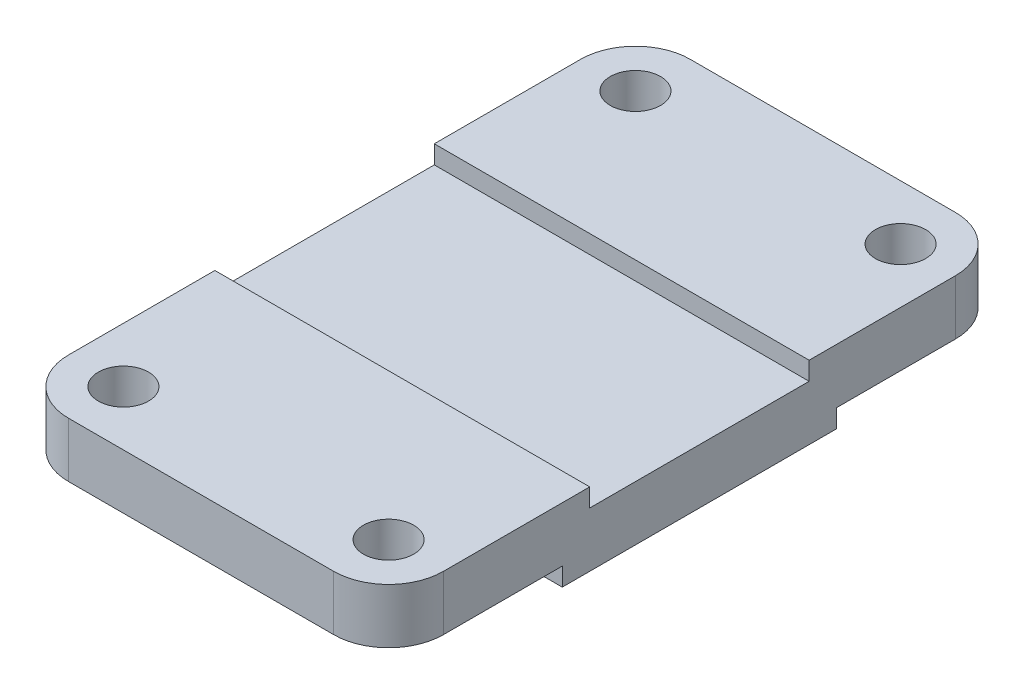
ISO-10303-21;
HEADER;
FILE_DESCRIPTION(('STEP AP214'),'2;1');
FILE_NAME('part.step','',(''),(''),'','','');
FILE_SCHEMA(('AUTOMOTIVE_DESIGN { 1 0 10303 214 1 1 1 1 }'));
ENDSEC;
DATA;
#1=APPLICATION_CONTEXT('core data for automotive mechanical design processes');
#2=APPLICATION_PROTOCOL_DEFINITION('international standard','automotive_design',2000,#1);
#3=PRODUCT_CONTEXT('',#1,'mechanical');
#4=PRODUCT('Part','Part','',(#3));
#5=PRODUCT_RELATED_PRODUCT_CATEGORY('part','',(#4));
#6=PRODUCT_DEFINITION_FORMATION('','',#4);
#7=PRODUCT_DEFINITION_CONTEXT('part definition',#1,'design');
#8=PRODUCT_DEFINITION('design','',#6,#7);
#9=PRODUCT_DEFINITION_SHAPE('','',#8);
#10=(LENGTH_UNIT() NAMED_UNIT(*) SI_UNIT(.MILLI.,.METRE.));
#11=(NAMED_UNIT(*) PLANE_ANGLE_UNIT() SI_UNIT($,.RADIAN.));
#12=(NAMED_UNIT(*) SI_UNIT($,.STERADIAN.) SOLID_ANGLE_UNIT());
#13=UNCERTAINTY_MEASURE_WITH_UNIT(LENGTH_MEASURE(1.E-05),#10,'distance_accuracy_value','');
#14=(GEOMETRIC_REPRESENTATION_CONTEXT(3) GLOBAL_UNCERTAINTY_ASSIGNED_CONTEXT((#13)) GLOBAL_UNIT_ASSIGNED_CONTEXT((#10,
#11,#12)) REPRESENTATION_CONTEXT('',''));
#15=CARTESIAN_POINT('',(0.,0.,0.));
#16=DIRECTION('',(0.,0.,1.));
#17=DIRECTION('',(1.,0.,0.));
#18=AXIS2_PLACEMENT_3D('',#15,#16,#17);
#19=CARTESIAN_POINT('',(41.,12.,-38.));
#20=DIRECTION('',(0.,-1.,0.));
#21=DIRECTION('',(0.,0.,-1.));
#22=AXIS2_PLACEMENT_3D('',#19,#20,#21);
#23=PLANE('',#22);
#24=DIRECTION('',(0.,0.,1.));
#25=VECTOR('',#24,1.);
#26=CARTESIAN_POINT('',(-41.,12.,-38.));
#27=LINE('',#26,#25);
#28=CARTESIAN_POINT('',(-41.,12.,-24.));
#29=VERTEX_POINT('',#28);
#30=CARTESIAN_POINT('',(-41.,12.,24.));
#31=VERTEX_POINT('',#30);
#32=EDGE_CURVE('E245',#29,#31,#27,.T.);
#33=ORIENTED_EDGE('',*,*,#32,.T.);
#34=DIRECTION('',(-1.,0.,0.));
#35=VECTOR('',#34,1.);
#36=CARTESIAN_POINT('',(41.,12.,24.));
#37=LINE('',#36,#35);
#38=CARTESIAN_POINT('',(41.,12.,24.));
#39=VERTEX_POINT('',#38);
#40=EDGE_CURVE('E175',#39,#31,#37,.T.);
#41=ORIENTED_EDGE('',*,*,#40,.F.);
#42=DIRECTION('',(0.,0.,1.));
#43=VECTOR('',#42,1.);
#44=CARTESIAN_POINT('',(41.,12.,-38.));
#45=LINE('',#44,#43);
#46=CARTESIAN_POINT('',(41.,12.,-24.));
#47=VERTEX_POINT('',#46);
#48=EDGE_CURVE('E180',#47,#39,#45,.T.);
#49=ORIENTED_EDGE('',*,*,#48,.F.);
#50=DIRECTION('',(-1.,0.,0.));
#51=VECTOR('',#50,1.);
#52=CARTESIAN_POINT('',(41.,12.,-24.));
#53=LINE('',#52,#51);
#54=EDGE_CURVE('E190',#47,#29,#53,.T.);
#55=ORIENTED_EDGE('',*,*,#54,.T.);
#56=EDGE_LOOP('',(#33,#41,#49,#55));
#57=FACE_BOUND('',#56,.T.);
#58=ADVANCED_FACE('F38',(#57),#23,.F.);
#59=CARTESIAN_POINT('',(-29.,0.,-56.));
#60=DIRECTION('',(0.,1.,0.));
#61=DIRECTION('',(0.,0.,1.));
#62=AXIS2_PLACEMENT_3D('',#59,#60,#61);
#63=PLANE('',#62);
#64=DIRECTION('',(0.,0.,-1.));
#65=VECTOR('',#64,1.);
#66=CARTESIAN_POINT('',(41.,0.,-56.));
#67=LINE('',#66,#65);
#68=CARTESIAN_POINT('',(41.0000000000001,0.,30.));
#69=VERTEX_POINT('',#68);
#70=CARTESIAN_POINT('',(41.0000000000001,0.,-30.));
#71=VERTEX_POINT('',#70);
#72=EDGE_CURVE('E265',#69,#71,#67,.T.);
#73=ORIENTED_EDGE('',*,*,#72,.F.);
#74=DIRECTION('',(-1.,0.,0.));
#75=VECTOR('',#74,1.);
#76=CARTESIAN_POINT('',(41.0000000000001,0.,30.));
#77=LINE('',#76,#75);
#78=CARTESIAN_POINT('',(-41.,0.,30.));
#79=VERTEX_POINT('',#78);
#80=EDGE_CURVE('E203',#69,#79,#77,.T.);
#81=ORIENTED_EDGE('',*,*,#80,.T.);
#82=DIRECTION('',(0.,0.,1.));
#83=VECTOR('',#82,1.);
#84=CARTESIAN_POINT('',(-41.,0.,-56.));
#85=LINE('',#84,#83);
#86=CARTESIAN_POINT('',(-41.,0.,-30.));
#87=VERTEX_POINT('',#86);
#88=EDGE_CURVE('E261',#87,#79,#85,.T.);
#89=ORIENTED_EDGE('',*,*,#88,.F.);
#90=DIRECTION('',(-1.,0.,0.));
#91=VECTOR('',#90,1.);
#92=CARTESIAN_POINT('',(41.0000000000001,0.,-30.));
#93=LINE('',#92,#91);
#94=EDGE_CURVE('E193',#71,#87,#93,.T.);
#95=ORIENTED_EDGE('',*,*,#94,.F.);
#96=EDGE_LOOP('',(#73,#81,#89,#95));
#97=FACE_BOUND('',#96,.T.);
#98=ADVANCED_FACE('F331',(#97),#63,.F.);
#99=CARTESIAN_POINT('',(-41.,16.,-56.));
#100=DIRECTION('',(1.,0.,0.));
#101=DIRECTION('',(0.,0.,-1.));
#102=AXIS2_PLACEMENT_3D('',#99,#100,#101);
#103=PLANE('',#102);
#104=DIRECTION('',(0.,-1.,0.));
#105=VECTOR('',#104,1.);
#106=CARTESIAN_POINT('',(-41.,0.,24.));
#107=LINE('',#106,#105);
#108=CARTESIAN_POINT('',(-41.,16.,24.));
#109=VERTEX_POINT('',#108);
#110=EDGE_CURVE('E174',#109,#31,#107,.T.);
#111=ORIENTED_EDGE('',*,*,#110,.T.);
#112=ORIENTED_EDGE('',*,*,#32,.F.);
#113=DIRECTION('',(0.,-1.,0.));
#114=VECTOR('',#113,1.);
#115=CARTESIAN_POINT('',(-41.,0.,-24.));
#116=LINE('',#115,#114);
#117=CARTESIAN_POINT('',(-41.,16.,-24.));
#118=VERTEX_POINT('',#117);
#119=EDGE_CURVE('E184',#118,#29,#116,.T.);
#120=ORIENTED_EDGE('',*,*,#119,.F.);
#121=DIRECTION('',(0.,0.,1.));
#122=VECTOR('',#121,1.);
#123=CARTESIAN_POINT('',(-41.,16.,-56.));
#124=LINE('',#123,#122);
#125=CARTESIAN_POINT('',(-41.,16.,-56.));
#126=VERTEX_POINT('',#125);
#127=EDGE_CURVE('E266',#126,#118,#124,.T.);
#128=ORIENTED_EDGE('',*,*,#127,.F.);
#129=DIRECTION('',(0.,-1.,0.));
#130=VECTOR('',#129,1.);
#131=CARTESIAN_POINT('',(-41.,16.,-56.));
#132=LINE('',#131,#130);
#133=CARTESIAN_POINT('',(-41.,4.,-56.));
#134=VERTEX_POINT('',#133);
#135=EDGE_CURVE('E11',#126,#134,#132,.T.);
#136=ORIENTED_EDGE('',*,*,#135,.T.);
#137=DIRECTION('',(0.,0.,-1.));
#138=VECTOR('',#137,1.);
#139=CARTESIAN_POINT('',(-41.,4.,0.));
#140=LINE('',#139,#138);
#141=CARTESIAN_POINT('',(-41.,4.,-30.));
#142=VERTEX_POINT('',#141);
#143=EDGE_CURVE('E221',#142,#134,#140,.T.);
#144=ORIENTED_EDGE('',*,*,#143,.F.);
#145=DIRECTION('',(0.,-1.,0.));
#146=VECTOR('',#145,1.);
#147=CARTESIAN_POINT('',(-41.,4.,-30.));
#148=LINE('',#147,#146);
#149=EDGE_CURVE('E202',#142,#87,#148,.T.);
#150=ORIENTED_EDGE('',*,*,#149,.T.);
#151=ORIENTED_EDGE('',*,*,#88,.T.);
#152=DIRECTION('',(0.,-1.,0.));
#153=VECTOR('',#152,1.);
#154=CARTESIAN_POINT('',(-41.,0.,30.));
#155=LINE('',#154,#153);
#156=CARTESIAN_POINT('',(-41.,4.,30.));
#157=VERTEX_POINT('',#156);
#158=EDGE_CURVE('E200',#157,#79,#155,.T.);
#159=ORIENTED_EDGE('',*,*,#158,.F.);
#160=DIRECTION('',(0.,0.,1.));
#161=VECTOR('',#160,1.);
#162=CARTESIAN_POINT('',(-41.,4.,0.));
#163=LINE('',#162,#161);
#164=CARTESIAN_POINT('',(-41.,4.,56.));
#165=VERTEX_POINT('',#164);
#166=EDGE_CURVE('E206',#157,#165,#163,.T.);
#167=ORIENTED_EDGE('',*,*,#166,.T.);
#168=DIRECTION('',(0.,-1.,0.));
#169=VECTOR('',#168,1.);
#170=CARTESIAN_POINT('',(-41.,16.,56.));
#171=LINE('',#170,#169);
#172=CARTESIAN_POINT('',(-41.,16.,56.));
#173=VERTEX_POINT('',#172);
#174=EDGE_CURVE('E47',#173,#165,#171,.T.);
#175=ORIENTED_EDGE('',*,*,#174,.F.);
#176=EDGE_CURVE('E264',#109,#173,#124,.T.);
#177=ORIENTED_EDGE('',*,*,#176,.F.);
#178=EDGE_LOOP('',(#111,#112,#120,#128,#136,#144,#150,#151,#159,#167,#175,#177));
#179=FACE_BOUND('',#178,.T.);
#180=ADVANCED_FACE('F328',(#179),#103,.F.);
#181=CARTESIAN_POINT('',(41.,16.,-56.));
#182=DIRECTION('',(-1.,0.,0.));
#183=DIRECTION('',(0.,0.,1.));
#184=AXIS2_PLACEMENT_3D('',#181,#182,#183);
#185=PLANE('',#184);
#186=ORIENTED_EDGE('',*,*,#48,.T.);
#187=DIRECTION('',(0.,-1.,0.));
#188=VECTOR('',#187,1.);
#189=CARTESIAN_POINT('',(41.,0.,24.));
#190=LINE('',#189,#188);
#191=CARTESIAN_POINT('',(41.,16.,24.));
#192=VERTEX_POINT('',#191);
#193=EDGE_CURVE('E171',#192,#39,#190,.T.);
#194=ORIENTED_EDGE('',*,*,#193,.F.);
#195=DIRECTION('',(0.,0.,-1.));
#196=VECTOR('',#195,1.);
#197=CARTESIAN_POINT('',(41.,16.,-56.));
#198=LINE('',#197,#196);
#199=CARTESIAN_POINT('',(41.,16.,56.));
#200=VERTEX_POINT('',#199);
#201=EDGE_CURVE('E154',#200,#192,#198,.T.);
#202=ORIENTED_EDGE('',*,*,#201,.F.);
#203=DIRECTION('',(0.,-1.,0.));
#204=VECTOR('',#203,1.);
#205=CARTESIAN_POINT('',(41.,16.,56.));
#206=LINE('',#205,#204);
#207=CARTESIAN_POINT('',(41.0000000000001,4.,56.));
#208=VERTEX_POINT('',#207);
#209=EDGE_CURVE('E288',#200,#208,#206,.T.);
#210=ORIENTED_EDGE('',*,*,#209,.T.);
#211=DIRECTION('',(0.,0.,1.));
#212=VECTOR('',#211,1.);
#213=CARTESIAN_POINT('',(41.0000000000001,4.,0.));
#214=LINE('',#213,#212);
#215=CARTESIAN_POINT('',(41.0000000000001,4.,30.));
#216=VERTEX_POINT('',#215);
#217=EDGE_CURVE('E226',#216,#208,#214,.T.);
#218=ORIENTED_EDGE('',*,*,#217,.F.);
#219=DIRECTION('',(0.,-1.,0.));
#220=VECTOR('',#219,1.);
#221=CARTESIAN_POINT('',(41.0000000000001,0.,30.));
#222=LINE('',#221,#220);
#223=EDGE_CURVE('E196',#216,#69,#222,.T.);
#224=ORIENTED_EDGE('',*,*,#223,.T.);
#225=ORIENTED_EDGE('',*,*,#72,.T.);
#226=DIRECTION('',(0.,-1.,0.));
#227=VECTOR('',#226,1.);
#228=CARTESIAN_POINT('',(41.0000000000001,4.,-30.));
#229=LINE('',#228,#227);
#230=CARTESIAN_POINT('',(41.0000000000001,4.,-30.));
#231=VERTEX_POINT('',#230);
#232=EDGE_CURVE('E213',#231,#71,#229,.T.);
#233=ORIENTED_EDGE('',*,*,#232,.F.);
#234=DIRECTION('',(0.,0.,-1.));
#235=VECTOR('',#234,1.);
#236=CARTESIAN_POINT('',(41.0000000000001,4.,0.));
#237=LINE('',#236,#235);
#238=CARTESIAN_POINT('',(41.,4.,-56.));
#239=VERTEX_POINT('',#238);
#240=EDGE_CURVE('E217',#231,#239,#237,.T.);
#241=ORIENTED_EDGE('',*,*,#240,.T.);
#242=DIRECTION('',(0.,-1.,0.));
#243=VECTOR('',#242,1.);
#244=CARTESIAN_POINT('',(41.,16.,-56.));
#245=LINE('',#244,#243);
#246=CARTESIAN_POINT('',(41.,16.,-56.));
#247=VERTEX_POINT('',#246);
#248=EDGE_CURVE('E285',#247,#239,#245,.T.);
#249=ORIENTED_EDGE('',*,*,#248,.F.);
#250=CARTESIAN_POINT('',(41.,16.,-24.));
#251=VERTEX_POINT('',#250);
#252=EDGE_CURVE('E167',#251,#247,#198,.T.);
#253=ORIENTED_EDGE('',*,*,#252,.F.);
#254=DIRECTION('',(0.,-1.,0.));
#255=VECTOR('',#254,1.);
#256=CARTESIAN_POINT('',(41.,0.,-24.));
#257=LINE('',#256,#255);
#258=EDGE_CURVE('E186',#251,#47,#257,.T.);
#259=ORIENTED_EDGE('',*,*,#258,.T.);
#260=EDGE_LOOP('',(#186,#194,#202,#210,#218,#224,#225,#233,#241,#249,#253,#259));
#261=FACE_BOUND('',#260,.T.);
#262=ADVANCED_FACE('F178',(#261),#185,.F.);
#263=CARTESIAN_POINT('',(-29.,16.,56.));
#264=DIRECTION('',(0.,-1.,0.));
#265=DIRECTION('',(0.,0.,-1.));
#266=AXIS2_PLACEMENT_3D('',#263,#264,#265);
#267=CYLINDRICAL_SURFACE('',#266,12.);
#268=CARTESIAN_POINT('',(-29.,4.,56.));
#269=DIRECTION('',(0.,-1.,0.));
#270=DIRECTION('',(0.,0.,-1.));
#271=AXIS2_PLACEMENT_3D('',#268,#269,#270);
#272=CIRCLE('',#271,12.);
#273=CARTESIAN_POINT('',(-29.,4.,68.));
#274=VERTEX_POINT('',#273);
#275=EDGE_CURVE('E243',#274,#165,#272,.T.);
#276=ORIENTED_EDGE('',*,*,#275,.F.);
#277=DIRECTION('',(0.,-1.,0.));
#278=VECTOR('',#277,1.);
#279=CARTESIAN_POINT('',(-29.,16.,68.));
#280=LINE('',#279,#278);
#281=CARTESIAN_POINT('',(-29.,16.,68.));
#282=VERTEX_POINT('',#281);
#283=EDGE_CURVE('E293',#282,#274,#280,.T.);
#284=ORIENTED_EDGE('',*,*,#283,.F.);
#285=CARTESIAN_POINT('',(-29.,16.,56.));
#286=DIRECTION('',(0.,1.,0.));
#287=DIRECTION('',(0.,0.,1.));
#288=AXIS2_PLACEMENT_3D('',#285,#286,#287);
#289=CIRCLE('',#288,12.);
#290=EDGE_CURVE('E268',#173,#282,#289,.T.);
#291=ORIENTED_EDGE('',*,*,#290,.F.);
#292=ORIENTED_EDGE('',*,*,#174,.T.);
#293=EDGE_LOOP('',(#276,#284,#291,#292));
#294=FACE_BOUND('',#293,.T.);
#295=ADVANCED_FACE('F363',(#294),#267,.T.);
#296=CARTESIAN_POINT('',(-29.,16.,68.));
#297=DIRECTION('',(0.,0.,-1.));
#298=DIRECTION('',(-1.,0.,0.));
#299=AXIS2_PLACEMENT_3D('',#296,#297,#298);
#300=PLANE('',#299);
#301=DIRECTION('',(-1.,0.,0.));
#302=VECTOR('',#301,1.);
#303=CARTESIAN_POINT('',(41.0000000000001,4.,68.));
#304=LINE('',#303,#302);
#305=CARTESIAN_POINT('',(29.,4.,68.));
#306=VERTEX_POINT('',#305);
#307=EDGE_CURVE('E223',#306,#274,#304,.T.);
#308=ORIENTED_EDGE('',*,*,#307,.F.);
#309=DIRECTION('',(0.,-1.,0.));
#310=VECTOR('',#309,1.);
#311=CARTESIAN_POINT('',(29.,16.,68.));
#312=LINE('',#311,#310);
#313=CARTESIAN_POINT('',(29.,16.,68.));
#314=VERTEX_POINT('',#313);
#315=EDGE_CURVE('E290',#314,#306,#312,.T.);
#316=ORIENTED_EDGE('',*,*,#315,.F.);
#317=DIRECTION('',(1.,0.,0.));
#318=VECTOR('',#317,1.);
#319=CARTESIAN_POINT('',(-29.,16.,68.));
#320=LINE('',#319,#318);
#321=EDGE_CURVE('E270',#282,#314,#320,.T.);
#322=ORIENTED_EDGE('',*,*,#321,.F.);
#323=ORIENTED_EDGE('',*,*,#283,.T.);
#324=EDGE_LOOP('',(#308,#316,#322,#323));
#325=FACE_BOUND('',#324,.T.);
#326=ADVANCED_FACE('F366',(#325),#300,.F.);
#327=CARTESIAN_POINT('',(29.,16.,56.));
#328=DIRECTION('',(0.,-1.,0.));
#329=DIRECTION('',(0.,0.,-1.));
#330=AXIS2_PLACEMENT_3D('',#327,#328,#329);
#331=CYLINDRICAL_SURFACE('',#330,12.);
#332=CARTESIAN_POINT('',(29.,4.,56.));
#333=DIRECTION('',(0.,-1.,0.));
#334=DIRECTION('',(0.,0.,-1.));
#335=AXIS2_PLACEMENT_3D('',#332,#333,#334);
#336=CIRCLE('',#335,12.);
#337=EDGE_CURVE('E241',#208,#306,#336,.T.);
#338=ORIENTED_EDGE('',*,*,#337,.F.);
#339=ORIENTED_EDGE('',*,*,#209,.F.);
#340=CARTESIAN_POINT('',(29.,16.,56.));
#341=DIRECTION('',(0.,1.,0.));
#342=DIRECTION('',(0.,0.,1.));
#343=AXIS2_PLACEMENT_3D('',#340,#341,#342);
#344=CIRCLE('',#343,12.);
#345=EDGE_CURVE('E161',#314,#200,#344,.T.);
#346=ORIENTED_EDGE('',*,*,#345,.F.);
#347=ORIENTED_EDGE('',*,*,#315,.T.);
#348=EDGE_LOOP('',(#338,#339,#346,#347));
#349=FACE_BOUND('',#348,.T.);
#350=ADVANCED_FACE('F344',(#349),#331,.T.);
#351=CARTESIAN_POINT('',(29.,0.,56.));
#352=DIRECTION('',(0.,1.,0.));
#353=DIRECTION('',(0.,0.,1.));
#354=AXIS2_PLACEMENT_3D('',#351,#352,#353);
#355=CYLINDRICAL_SURFACE('',#354,5.5);
#356=CARTESIAN_POINT('',(29.,16.,56.));
#357=DIRECTION('',(0.,1.,0.));
#358=DIRECTION('',(0.,0.,1.));
#359=AXIS2_PLACEMENT_3D('',#356,#357,#358);
#360=CIRCLE('',#359,5.5);
#361=CARTESIAN_POINT('',(29.,16.,61.5));
#362=VERTEX_POINT('',#361);
#363=EDGE_CURVE('E247',#362,#362,#360,.F.);
#364=ORIENTED_EDGE('',*,*,#363,.F.);
#365=EDGE_LOOP('',(#364));
#366=FACE_BOUND('',#365,.T.);
#367=CARTESIAN_POINT('',(29.,4.,56.));
#368=DIRECTION('',(0.,-1.,0.));
#369=DIRECTION('',(0.,0.,-1.));
#370=AXIS2_PLACEMENT_3D('',#367,#368,#369);
#371=CIRCLE('',#370,5.5);
#372=CARTESIAN_POINT('',(29.,4.,50.5));
#373=VERTEX_POINT('',#372);
#374=EDGE_CURVE('E238',#373,#373,#371,.T.);
#375=ORIENTED_EDGE('',*,*,#374,.T.);
#376=EDGE_LOOP('',(#375));
#377=FACE_BOUND('',#376,.T.);
#378=ADVANCED_FACE('F340',(#366,#377),#355,.F.);
#379=CARTESIAN_POINT('',(-29.,0.,56.));
#380=DIRECTION('',(0.,1.,0.));
#381=DIRECTION('',(0.,0.,1.));
#382=AXIS2_PLACEMENT_3D('',#379,#380,#381);
#383=CYLINDRICAL_SURFACE('',#382,5.5);
#384=CARTESIAN_POINT('',(-29.,16.,56.));
#385=DIRECTION('',(0.,1.,0.));
#386=DIRECTION('',(0.,0.,1.));
#387=AXIS2_PLACEMENT_3D('',#384,#385,#386);
#388=CIRCLE('',#387,5.5);
#389=CARTESIAN_POINT('',(-29.,16.,61.5));
#390=VERTEX_POINT('',#389);
#391=EDGE_CURVE('E252',#390,#390,#388,.T.);
#392=ORIENTED_EDGE('',*,*,#391,.T.);
#393=EDGE_LOOP('',(#392));
#394=FACE_BOUND('',#393,.T.);
#395=CARTESIAN_POINT('',(-29.,4.,56.));
#396=DIRECTION('',(0.,-1.,0.));
#397=DIRECTION('',(0.,0.,-1.));
#398=AXIS2_PLACEMENT_3D('',#395,#396,#397);
#399=CIRCLE('',#398,5.5);
#400=CARTESIAN_POINT('',(-29.,4.,50.5));
#401=VERTEX_POINT('',#400);
#402=EDGE_CURVE('E42',#401,#401,#399,.F.);
#403=ORIENTED_EDGE('',*,*,#402,.F.);
#404=EDGE_LOOP('',(#403));
#405=FACE_BOUND('',#404,.T.);
#406=ADVANCED_FACE('F343',(#394,#405),#383,.F.);
#407=CARTESIAN_POINT('',(-29.,16.,-56.));
#408=DIRECTION('',(0.,1.,0.));
#409=DIRECTION('',(0.,0.,1.));
#410=AXIS2_PLACEMENT_3D('',#407,#408,#409);
#411=PLANE('',#410);
#412=ORIENTED_EDGE('',*,*,#201,.T.);
#413=DIRECTION('',(-1.,0.,0.));
#414=VECTOR('',#413,1.);
#415=CARTESIAN_POINT('',(41.,16.,24.));
#416=LINE('',#415,#414);
#417=EDGE_CURVE('E158',#192,#109,#416,.T.);
#418=ORIENTED_EDGE('',*,*,#417,.T.);
#419=ORIENTED_EDGE('',*,*,#176,.T.);
#420=ORIENTED_EDGE('',*,*,#290,.T.);
#421=ORIENTED_EDGE('',*,*,#321,.T.);
#422=ORIENTED_EDGE('',*,*,#345,.T.);
#423=EDGE_LOOP('',(#412,#418,#419,#420,#421,#422));
#424=FACE_BOUND('',#423,.T.);
#425=ORIENTED_EDGE('',*,*,#391,.F.);
#426=EDGE_LOOP('',(#425));
#427=FACE_BOUND('',#426,.T.);
#428=ORIENTED_EDGE('',*,*,#363,.T.);
#429=EDGE_LOOP('',(#428));
#430=FACE_BOUND('',#429,.T.);
#431=ADVANCED_FACE('F156',(#424,#427,#430),#411,.T.);
#432=ORIENTED_EDGE('',*,*,#127,.T.);
#433=DIRECTION('',(-1.,0.,0.));
#434=VECTOR('',#433,1.);
#435=CARTESIAN_POINT('',(41.,16.,-24.));
#436=LINE('',#435,#434);
#437=EDGE_CURVE('E188',#251,#118,#436,.T.);
#438=ORIENTED_EDGE('',*,*,#437,.F.);
#439=ORIENTED_EDGE('',*,*,#252,.T.);
#440=CARTESIAN_POINT('',(29.,16.,-56.));
#441=DIRECTION('',(0.,1.,0.));
#442=DIRECTION('',(0.,0.,-1.));
#443=AXIS2_PLACEMENT_3D('',#440,#441,#442);
#444=CIRCLE('',#443,12.);
#445=CARTESIAN_POINT('',(29.,16.,-68.));
#446=VERTEX_POINT('',#445);
#447=EDGE_CURVE('E166',#247,#446,#444,.T.);
#448=ORIENTED_EDGE('',*,*,#447,.T.);
#449=DIRECTION('',(-1.,0.,0.));
#450=VECTOR('',#449,1.);
#451=CARTESIAN_POINT('',(-29.,16.,-68.));
#452=LINE('',#451,#450);
#453=CARTESIAN_POINT('',(-29.,16.,-68.));
#454=VERTEX_POINT('',#453);
#455=EDGE_CURVE('E63',#446,#454,#452,.T.);
#456=ORIENTED_EDGE('',*,*,#455,.T.);
#457=CARTESIAN_POINT('',(-29.,16.,-56.));
#458=DIRECTION('',(0.,1.,0.));
#459=DIRECTION('',(0.,0.,1.));
#460=AXIS2_PLACEMENT_3D('',#457,#458,#459);
#461=CIRCLE('',#460,12.);
#462=EDGE_CURVE('E262',#454,#126,#461,.T.);
#463=ORIENTED_EDGE('',*,*,#462,.T.);
#464=EDGE_LOOP('',(#432,#438,#439,#448,#456,#463));
#465=FACE_BOUND('',#464,.T.);
#466=CARTESIAN_POINT('',(-29.,16.,-56.));
#467=DIRECTION('',(0.,1.,0.));
#468=DIRECTION('',(0.,0.,1.));
#469=AXIS2_PLACEMENT_3D('',#466,#467,#468);
#470=CIRCLE('',#469,5.5);
#471=CARTESIAN_POINT('',(-29.,16.,-50.5));
#472=VERTEX_POINT('',#471);
#473=EDGE_CURVE('E256',#472,#472,#470,.F.);
#474=ORIENTED_EDGE('',*,*,#473,.T.);
#475=EDGE_LOOP('',(#474));
#476=FACE_BOUND('',#475,.T.);
#477=CARTESIAN_POINT('',(29.,16.,-56.));
#478=DIRECTION('',(0.,1.,0.));
#479=DIRECTION('',(0.,0.,1.));
#480=AXIS2_PLACEMENT_3D('',#477,#478,#479);
#481=CIRCLE('',#480,5.5);
#482=CARTESIAN_POINT('',(29.,16.,-50.5));
#483=VERTEX_POINT('',#482);
#484=EDGE_CURVE('E253',#483,#483,#481,.T.);
#485=ORIENTED_EDGE('',*,*,#484,.F.);
#486=EDGE_LOOP('',(#485));
#487=FACE_BOUND('',#486,.T.);
#488=ADVANCED_FACE('F318',(#465,#476,#487),#411,.T.);
#489=CARTESIAN_POINT('',(-29.,16.,-56.));
#490=DIRECTION('',(0.,-1.,0.));
#491=DIRECTION('',(0.,0.,-1.));
#492=AXIS2_PLACEMENT_3D('',#489,#490,#491);
#493=CYLINDRICAL_SURFACE('',#492,12.);
#494=DIRECTION('',(0.,-1.,0.));
#495=VECTOR('',#494,1.);
#496=CARTESIAN_POINT('',(-29.,16.,-68.));
#497=LINE('',#496,#495);
#498=CARTESIAN_POINT('',(-29.,4.,-68.));
#499=VERTEX_POINT('',#498);
#500=EDGE_CURVE('E275',#454,#499,#497,.T.);
#501=ORIENTED_EDGE('',*,*,#500,.T.);
#502=CARTESIAN_POINT('',(-29.,4.,-56.));
#503=DIRECTION('',(0.,1.,0.));
#504=DIRECTION('',(0.,0.,1.));
#505=AXIS2_PLACEMENT_3D('',#502,#503,#504);
#506=CIRCLE('',#505,12.);
#507=EDGE_CURVE('E55',#499,#134,#506,.T.);
#508=ORIENTED_EDGE('',*,*,#507,.T.);
#509=ORIENTED_EDGE('',*,*,#135,.F.);
#510=ORIENTED_EDGE('',*,*,#462,.F.);
#511=EDGE_LOOP('',(#501,#508,#509,#510));
#512=FACE_BOUND('',#511,.T.);
#513=ADVANCED_FACE('F40',(#512),#493,.T.);
#514=CARTESIAN_POINT('',(29.,16.,-56.));
#515=DIRECTION('',(0.,-1.,0.));
#516=DIRECTION('',(0.,0.,-1.));
#517=AXIS2_PLACEMENT_3D('',#514,#515,#516);
#518=CYLINDRICAL_SURFACE('',#517,12.);
#519=ORIENTED_EDGE('',*,*,#248,.T.);
#520=CARTESIAN_POINT('',(29.,4.,-56.));
#521=DIRECTION('',(0.,1.,0.));
#522=DIRECTION('',(0.,0.,1.));
#523=AXIS2_PLACEMENT_3D('',#520,#521,#522);
#524=CIRCLE('',#523,12.);
#525=CARTESIAN_POINT('',(29.,4.,-68.));
#526=VERTEX_POINT('',#525);
#527=EDGE_CURVE('E234',#239,#526,#524,.T.);
#528=ORIENTED_EDGE('',*,*,#527,.T.);
#529=DIRECTION('',(0.,-1.,0.));
#530=VECTOR('',#529,1.);
#531=CARTESIAN_POINT('',(29.,16.,-68.));
#532=LINE('',#531,#530);
#533=EDGE_CURVE('E282',#446,#526,#532,.T.);
#534=ORIENTED_EDGE('',*,*,#533,.F.);
#535=ORIENTED_EDGE('',*,*,#447,.F.);
#536=EDGE_LOOP('',(#519,#528,#534,#535));
#537=FACE_BOUND('',#536,.T.);
#538=ADVANCED_FACE('F311',(#537),#518,.T.);
#539=CARTESIAN_POINT('',(-29.,16.,-68.));
#540=DIRECTION('',(0.,0.,1.));
#541=DIRECTION('',(1.,0.,0.));
#542=AXIS2_PLACEMENT_3D('',#539,#540,#541);
#543=PLANE('',#542);
#544=ORIENTED_EDGE('',*,*,#533,.T.);
#545=DIRECTION('',(-1.,0.,0.));
#546=VECTOR('',#545,1.);
#547=CARTESIAN_POINT('',(41.,4.,-68.));
#548=LINE('',#547,#546);
#549=EDGE_CURVE('E220',#526,#499,#548,.T.);
#550=ORIENTED_EDGE('',*,*,#549,.T.);
#551=ORIENTED_EDGE('',*,*,#500,.F.);
#552=ORIENTED_EDGE('',*,*,#455,.F.);
#553=EDGE_LOOP('',(#544,#550,#551,#552));
#554=FACE_BOUND('',#553,.T.);
#555=ADVANCED_FACE('F314',(#554),#543,.F.);
#556=CARTESIAN_POINT('',(-29.,0.,-56.));
#557=DIRECTION('',(0.,1.,0.));
#558=DIRECTION('',(0.,0.,1.));
#559=AXIS2_PLACEMENT_3D('',#556,#557,#558);
#560=CYLINDRICAL_SURFACE('',#559,5.5);
#561=CARTESIAN_POINT('',(-29.,4.,-56.));
#562=DIRECTION('',(0.,1.,0.));
#563=DIRECTION('',(0.,0.,1.));
#564=AXIS2_PLACEMENT_3D('',#561,#562,#563);
#565=CIRCLE('',#564,5.5);
#566=CARTESIAN_POINT('',(-29.,4.,-50.5));
#567=VERTEX_POINT('',#566);
#568=EDGE_CURVE('E231',#567,#567,#565,.T.);
#569=ORIENTED_EDGE('',*,*,#568,.F.);
#570=EDGE_LOOP('',(#569));
#571=FACE_BOUND('',#570,.T.);
#572=ORIENTED_EDGE('',*,*,#473,.F.);
#573=EDGE_LOOP('',(#572));
#574=FACE_BOUND('',#573,.T.);
#575=ADVANCED_FACE('F348',(#571,#574),#560,.F.);
#576=CARTESIAN_POINT('',(29.,0.,-56.));
#577=DIRECTION('',(0.,1.,0.));
#578=DIRECTION('',(0.,0.,1.));
#579=AXIS2_PLACEMENT_3D('',#576,#577,#578);
#580=CYLINDRICAL_SURFACE('',#579,5.5);
#581=CARTESIAN_POINT('',(29.,4.,-56.));
#582=DIRECTION('',(0.,1.,0.));
#583=DIRECTION('',(0.,0.,1.));
#584=AXIS2_PLACEMENT_3D('',#581,#582,#583);
#585=CIRCLE('',#584,5.5);
#586=CARTESIAN_POINT('',(29.,4.,-50.5));
#587=VERTEX_POINT('',#586);
#588=EDGE_CURVE('E225',#587,#587,#585,.F.);
#589=ORIENTED_EDGE('',*,*,#588,.T.);
#590=EDGE_LOOP('',(#589));
#591=FACE_BOUND('',#590,.T.);
#592=ORIENTED_EDGE('',*,*,#484,.T.);
#593=EDGE_LOOP('',(#592));
#594=FACE_BOUND('',#593,.T.);
#595=ADVANCED_FACE('F300',(#591,#594),#580,.F.);
#596=CARTESIAN_POINT('',(41.0000000000001,4.,0.));
#597=DIRECTION('',(0.,1.,0.));
#598=DIRECTION('',(0.,0.,1.));
#599=AXIS2_PLACEMENT_3D('',#596,#597,#598);
#600=PLANE('',#599);
#601=ORIENTED_EDGE('',*,*,#568,.T.);
#602=EDGE_LOOP('',(#601));
#603=FACE_BOUND('',#602,.T.);
#604=ORIENTED_EDGE('',*,*,#588,.F.);
#605=EDGE_LOOP('',(#604));
#606=FACE_BOUND('',#605,.T.);
#607=ORIENTED_EDGE('',*,*,#549,.F.);
#608=ORIENTED_EDGE('',*,*,#527,.F.);
#609=ORIENTED_EDGE('',*,*,#240,.F.);
#610=DIRECTION('',(-1.,0.,0.));
#611=VECTOR('',#610,1.);
#612=CARTESIAN_POINT('',(41.0000000000001,4.,-30.));
#613=LINE('',#612,#611);
#614=EDGE_CURVE('E210',#231,#142,#613,.T.);
#615=ORIENTED_EDGE('',*,*,#614,.T.);
#616=ORIENTED_EDGE('',*,*,#143,.T.);
#617=ORIENTED_EDGE('',*,*,#507,.F.);
#618=EDGE_LOOP('',(#607,#608,#609,#615,#616,#617));
#619=FACE_BOUND('',#618,.T.);
#620=ADVANCED_FACE('F303',(#603,#606,#619),#600,.F.);
#621=CARTESIAN_POINT('',(41.0000000000001,4.,0.));
#622=DIRECTION('',(0.,-1.,0.));
#623=DIRECTION('',(0.,0.,-1.));
#624=AXIS2_PLACEMENT_3D('',#621,#622,#623);
#625=PLANE('',#624);
#626=ORIENTED_EDGE('',*,*,#374,.F.);
#627=EDGE_LOOP('',(#626));
#628=FACE_BOUND('',#627,.T.);
#629=ORIENTED_EDGE('',*,*,#402,.T.);
#630=EDGE_LOOP('',(#629));
#631=FACE_BOUND('',#630,.T.);
#632=ORIENTED_EDGE('',*,*,#275,.T.);
#633=ORIENTED_EDGE('',*,*,#166,.F.);
#634=DIRECTION('',(-1.,0.,0.));
#635=VECTOR('',#634,1.);
#636=CARTESIAN_POINT('',(41.0000000000001,4.,30.));
#637=LINE('',#636,#635);
#638=EDGE_CURVE('E199',#216,#157,#637,.T.);
#639=ORIENTED_EDGE('',*,*,#638,.F.);
#640=ORIENTED_EDGE('',*,*,#217,.T.);
#641=ORIENTED_EDGE('',*,*,#337,.T.);
#642=ORIENTED_EDGE('',*,*,#307,.T.);
#643=EDGE_LOOP('',(#632,#633,#639,#640,#641,#642));
#644=FACE_BOUND('',#643,.T.);
#645=ADVANCED_FACE('F305',(#628,#631,#644),#625,.T.);
#646=CARTESIAN_POINT('',(41.0000000000001,0.,30.));
#647=DIRECTION('',(0.,0.,-1.));
#648=DIRECTION('',(0.,1.,0.));
#649=AXIS2_PLACEMENT_3D('',#646,#647,#648);
#650=PLANE('',#649);
#651=ORIENTED_EDGE('',*,*,#158,.T.);
#652=ORIENTED_EDGE('',*,*,#80,.F.);
#653=ORIENTED_EDGE('',*,*,#223,.F.);
#654=ORIENTED_EDGE('',*,*,#638,.T.);
#655=EDGE_LOOP('',(#651,#652,#653,#654));
#656=FACE_BOUND('',#655,.T.);
#657=ADVANCED_FACE('F443',(#656),#650,.F.);
#658=CARTESIAN_POINT('',(41.0000000000001,4.,-30.));
#659=DIRECTION('',(0.,0.,-1.));
#660=DIRECTION('',(-1.,0.,0.));
#661=AXIS2_PLACEMENT_3D('',#658,#659,#660);
#662=PLANE('',#661);
#663=ORIENTED_EDGE('',*,*,#149,.F.);
#664=ORIENTED_EDGE('',*,*,#614,.F.);
#665=ORIENTED_EDGE('',*,*,#232,.T.);
#666=ORIENTED_EDGE('',*,*,#94,.T.);
#667=EDGE_LOOP('',(#663,#664,#665,#666));
#668=FACE_BOUND('',#667,.T.);
#669=ADVANCED_FACE('F450',(#668),#662,.T.);
#670=CARTESIAN_POINT('',(41.,0.,-24.));
#671=DIRECTION('',(0.,0.,-1.));
#672=DIRECTION('',(-1.,0.,0.));
#673=AXIS2_PLACEMENT_3D('',#670,#671,#672);
#674=PLANE('',#673);
#675=ORIENTED_EDGE('',*,*,#119,.T.);
#676=ORIENTED_EDGE('',*,*,#54,.F.);
#677=ORIENTED_EDGE('',*,*,#258,.F.);
#678=ORIENTED_EDGE('',*,*,#437,.T.);
#679=EDGE_LOOP('',(#675,#676,#677,#678));
#680=FACE_BOUND('',#679,.T.);
#681=ADVANCED_FACE('F325',(#680),#674,.F.);
#682=CARTESIAN_POINT('',(41.,0.,24.));
#683=DIRECTION('',(0.,0.,-1.));
#684=DIRECTION('',(-1.,0.,0.));
#685=AXIS2_PLACEMENT_3D('',#682,#683,#684);
#686=PLANE('',#685);
#687=ORIENTED_EDGE('',*,*,#110,.F.);
#688=ORIENTED_EDGE('',*,*,#417,.F.);
#689=ORIENTED_EDGE('',*,*,#193,.T.);
#690=ORIENTED_EDGE('',*,*,#40,.T.);
#691=EDGE_LOOP('',(#687,#688,#689,#690));
#692=FACE_BOUND('',#691,.T.);
#693=ADVANCED_FACE('F170',(#692),#686,.T.);
#694=CLOSED_SHELL('',(#58,#98,#180,#262,#295,#326,#350,#378,#406,#431,#488,#513,#538,#555,#575,
#595,#620,#645,#657,#669,#681,#693));
#695=MANIFOLD_SOLID_BREP('B2',#694);
#696=ADVANCED_BREP_SHAPE_REPRESENTATION('',(#18,#695),#14);
#697=SHAPE_DEFINITION_REPRESENTATION(#9,#696);
ENDSEC;
END-ISO-10303-21;
